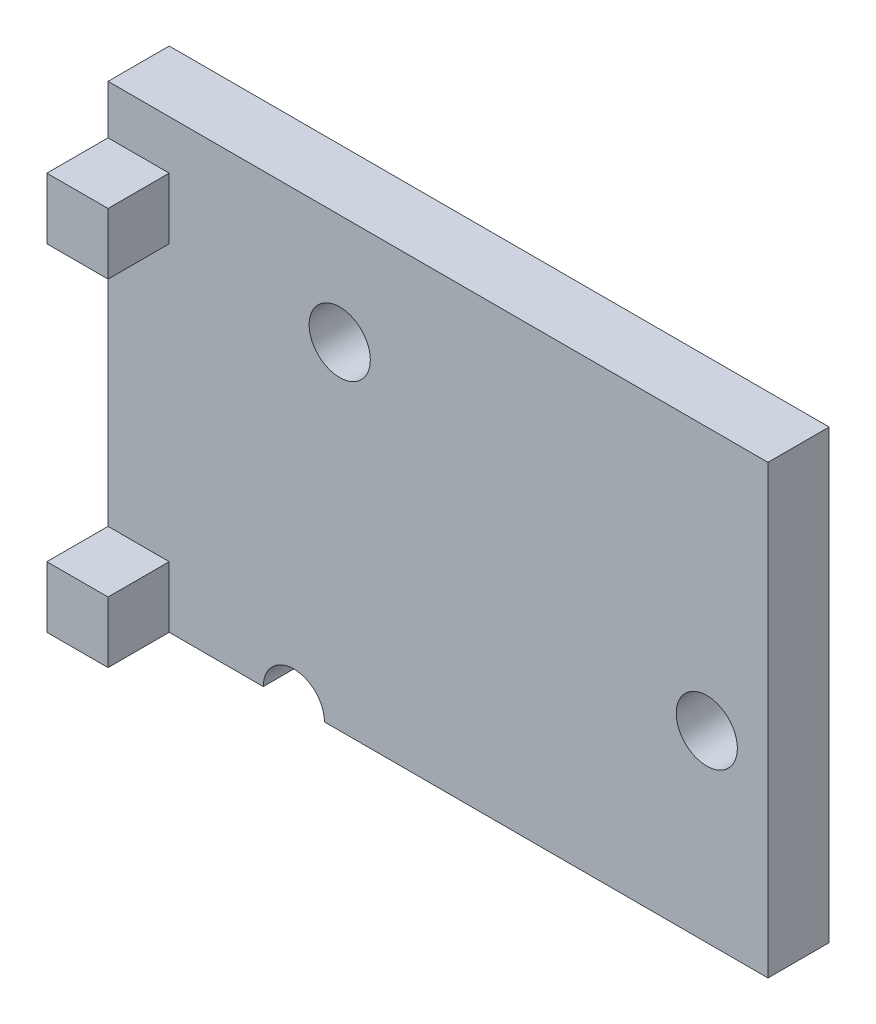
ISO-10303-21;
HEADER;
FILE_DESCRIPTION(('STEP AP214'),'2;1');
FILE_NAME('part.step','',(''),(''),'','','');
FILE_SCHEMA(('AUTOMOTIVE_DESIGN { 1 0 10303 214 1 1 1 1 }'));
ENDSEC;
DATA;
#1=APPLICATION_CONTEXT('core data for automotive mechanical design processes');
#2=APPLICATION_PROTOCOL_DEFINITION('international standard','automotive_design',2000,#1);
#3=PRODUCT_CONTEXT('',#1,'mechanical');
#4=PRODUCT('Part','Part','',(#3));
#5=PRODUCT_RELATED_PRODUCT_CATEGORY('part','',(#4));
#6=PRODUCT_DEFINITION_FORMATION('','',#4);
#7=PRODUCT_DEFINITION_CONTEXT('part definition',#1,'design');
#8=PRODUCT_DEFINITION('design','',#6,#7);
#9=PRODUCT_DEFINITION_SHAPE('','',#8);
#10=(LENGTH_UNIT() NAMED_UNIT(*) SI_UNIT(.MILLI.,.METRE.));
#11=(NAMED_UNIT(*) PLANE_ANGLE_UNIT() SI_UNIT($,.RADIAN.));
#12=(NAMED_UNIT(*) SI_UNIT($,.STERADIAN.) SOLID_ANGLE_UNIT());
#13=UNCERTAINTY_MEASURE_WITH_UNIT(LENGTH_MEASURE(1.E-05),#10,'distance_accuracy_value','');
#14=(GEOMETRIC_REPRESENTATION_CONTEXT(3) GLOBAL_UNCERTAINTY_ASSIGNED_CONTEXT((#13)) GLOBAL_UNIT_ASSIGNED_CONTEXT((#10,
#11,#12)) REPRESENTATION_CONTEXT('',''));
#15=CARTESIAN_POINT('',(0.,0.,0.));
#16=DIRECTION('',(0.,0.,1.));
#17=DIRECTION('',(1.,0.,0.));
#18=AXIS2_PLACEMENT_3D('',#15,#16,#17);
#19=CARTESIAN_POINT('',(4.5,3.25,1.));
#20=DIRECTION('',(0.,-1.,0.));
#21=DIRECTION('',(1.,0.,0.));
#22=AXIS2_PLACEMENT_3D('',#19,#20,#21);
#23=PLANE('',#22);
#24=DIRECTION('',(1.,0.,0.));
#25=VECTOR('',#24,1.);
#26=CARTESIAN_POINT('',(4.5,3.25,1.));
#27=LINE('',#26,#25);
#28=CARTESIAN_POINT('',(-6.2874,3.25,1.));
#29=VERTEX_POINT('',#28);
#30=CARTESIAN_POINT('',(-5.2874,3.25,1.));
#31=VERTEX_POINT('',#30);
#32=EDGE_CURVE('E159',#29,#31,#27,.T.);
#33=ORIENTED_EDGE('',*,*,#32,.F.);
#34=DIRECTION('',(0.,0.,-1.));
#35=VECTOR('',#34,1.);
#36=CARTESIAN_POINT('',(-6.2874,3.25,0.));
#37=LINE('',#36,#35);
#38=CARTESIAN_POINT('',(-6.2874,3.25,2.));
#39=VERTEX_POINT('',#38);
#40=EDGE_CURVE('E216',#39,#29,#37,.T.);
#41=ORIENTED_EDGE('',*,*,#40,.F.);
#42=DIRECTION('',(-1.,0.,0.));
#43=VECTOR('',#42,1.);
#44=CARTESIAN_POINT('',(-6.2874,3.25,2.));
#45=LINE('',#44,#43);
#46=CARTESIAN_POINT('',(-5.2874,3.25,2.));
#47=VERTEX_POINT('',#46);
#48=EDGE_CURVE('E196',#47,#39,#45,.T.);
#49=ORIENTED_EDGE('',*,*,#48,.F.);
#50=DIRECTION('',(0.,0.,-1.));
#51=VECTOR('',#50,1.);
#52=CARTESIAN_POINT('',(-5.2874,3.25,2.));
#53=LINE('',#52,#51);
#54=EDGE_CURVE('E199',#47,#31,#53,.T.);
#55=ORIENTED_EDGE('',*,*,#54,.T.);
#56=EDGE_LOOP('',(#33,#41,#49,#55));
#57=FACE_BOUND('',#56,.T.);
#58=ADVANCED_FACE('F33',(#57),#23,.F.);
#59=CARTESIAN_POINT('',(-3.25,-3.25,1.));
#60=DIRECTION('',(0.,0.,1.));
#61=DIRECTION('',(1.,0.,0.));
#62=AXIS2_PLACEMENT_3D('',#59,#60,#61);
#63=PLANE('',#62);
#64=CARTESIAN_POINT('',(3.5,-0.249999999999999,1.));
#65=DIRECTION('',(0.,0.,1.));
#66=DIRECTION('',(1.,0.,0.));
#67=AXIS2_PLACEMENT_3D('',#64,#65,#66);
#68=CIRCLE('',#67,0.500000000000001);
#69=CARTESIAN_POINT('',(4.,-0.249999999999999,1.));
#70=VERTEX_POINT('',#69);
#71=EDGE_CURVE('E223',#70,#70,#68,.T.);
#72=ORIENTED_EDGE('',*,*,#71,.F.);
#73=EDGE_LOOP('',(#72));
#74=FACE_BOUND('',#73,.T.);
#75=CARTESIAN_POINT('',(-2.5,2.25,1.));
#76=DIRECTION('',(0.,0.,1.));
#77=DIRECTION('',(1.,0.,0.));
#78=AXIS2_PLACEMENT_3D('',#75,#76,#77);
#79=CIRCLE('',#78,0.5);
#80=CARTESIAN_POINT('',(-2.,2.25,1.));
#81=VERTEX_POINT('',#80);
#82=EDGE_CURVE('E230',#81,#81,#79,.T.);
#83=ORIENTED_EDGE('',*,*,#82,.F.);
#84=EDGE_LOOP('',(#83));
#85=FACE_BOUND('',#84,.T.);
#86=DIRECTION('',(-1.,0.,0.));
#87=VECTOR('',#86,1.);
#88=CARTESIAN_POINT('',(-6.2874,-2.25,1.));
#89=LINE('',#88,#87);
#90=CARTESIAN_POINT('',(-5.2874,-2.25,1.));
#91=VERTEX_POINT('',#90);
#92=CARTESIAN_POINT('',(-6.2874,-2.25,1.));
#93=VERTEX_POINT('',#92);
#94=EDGE_CURVE('E172',#91,#93,#89,.T.);
#95=ORIENTED_EDGE('',*,*,#94,.F.);
#96=DIRECTION('',(0.,1.,0.));
#97=VECTOR('',#96,1.);
#98=CARTESIAN_POINT('',(-5.2874,-3.25,1.));
#99=LINE('',#98,#97);
#100=CARTESIAN_POINT('',(-5.2874,-3.25,1.));
#101=VERTEX_POINT('',#100);
#102=EDGE_CURVE('E178',#101,#91,#99,.T.);
#103=ORIENTED_EDGE('',*,*,#102,.F.);
#104=DIRECTION('',(1.,0.,0.));
#105=VECTOR('',#104,1.);
#106=CARTESIAN_POINT('',(-3.75,-3.25,1.));
#107=LINE('',#106,#105);
#108=CARTESIAN_POINT('',(-3.75,-3.25,1.));
#109=VERTEX_POINT('',#108);
#110=EDGE_CURVE('E142',#101,#109,#107,.T.);
#111=ORIENTED_EDGE('',*,*,#110,.T.);
#112=CARTESIAN_POINT('',(-3.25,-3.25,1.));
#113=DIRECTION('',(0.,0.,-1.));
#114=DIRECTION('',(1.,0.,0.));
#115=AXIS2_PLACEMENT_3D('',#112,#113,#114);
#116=CIRCLE('',#115,0.5);
#117=CARTESIAN_POINT('',(-2.75,-3.25,1.));
#118=VERTEX_POINT('',#117);
#119=EDGE_CURVE('E237',#109,#118,#116,.T.);
#120=ORIENTED_EDGE('',*,*,#119,.T.);
#121=DIRECTION('',(1.,0.,0.));
#122=VECTOR('',#121,1.);
#123=CARTESIAN_POINT('',(4.5,-3.25,1.));
#124=LINE('',#123,#122);
#125=CARTESIAN_POINT('',(4.5,-3.25,1.));
#126=VERTEX_POINT('',#125);
#127=EDGE_CURVE('E239',#118,#126,#124,.T.);
#128=ORIENTED_EDGE('',*,*,#127,.T.);
#129=DIRECTION('',(0.,1.,0.));
#130=VECTOR('',#129,1.);
#131=CARTESIAN_POINT('',(4.5,3.25,1.));
#132=LINE('',#131,#130);
#133=CARTESIAN_POINT('',(4.5,4.05,1.));
#134=VERTEX_POINT('',#133);
#135=EDGE_CURVE('E241',#126,#134,#132,.T.);
#136=ORIENTED_EDGE('',*,*,#135,.T.);
#137=DIRECTION('',(1.,0.,0.));
#138=VECTOR('',#137,1.);
#139=CARTESIAN_POINT('',(4.5,4.05,1.));
#140=LINE('',#139,#138);
#141=CARTESIAN_POINT('',(-6.2874,4.05,1.));
#142=VERTEX_POINT('',#141);
#143=EDGE_CURVE('E158',#142,#134,#140,.T.);
#144=ORIENTED_EDGE('',*,*,#143,.F.);
#145=DIRECTION('',(0.,-1.,0.));
#146=VECTOR('',#145,1.);
#147=CARTESIAN_POINT('',(-6.2874,4.05,1.));
#148=LINE('',#147,#146);
#149=EDGE_CURVE('E165',#142,#29,#148,.T.);
#150=ORIENTED_EDGE('',*,*,#149,.T.);
#151=ORIENTED_EDGE('',*,*,#32,.T.);
#152=DIRECTION('',(0.,1.,0.));
#153=VECTOR('',#152,1.);
#154=CARTESIAN_POINT('',(-5.2874,3.25,1.));
#155=LINE('',#154,#153);
#156=CARTESIAN_POINT('',(-5.2874,2.25,1.));
#157=VERTEX_POINT('',#156);
#158=EDGE_CURVE('E192',#157,#31,#155,.T.);
#159=ORIENTED_EDGE('',*,*,#158,.F.);
#160=DIRECTION('',(1.,0.,0.));
#161=VECTOR('',#160,1.);
#162=CARTESIAN_POINT('',(-6.2874,2.25,1.));
#163=LINE('',#162,#161);
#164=CARTESIAN_POINT('',(-6.2874,2.25,1.));
#165=VERTEX_POINT('',#164);
#166=EDGE_CURVE('E187',#165,#157,#163,.T.);
#167=ORIENTED_EDGE('',*,*,#166,.F.);
#168=DIRECTION('',(0.,1.,0.));
#169=VECTOR('',#168,1.);
#170=CARTESIAN_POINT('',(-6.2874,3.25,1.));
#171=LINE('',#170,#169);
#172=EDGE_CURVE('E55',#93,#165,#171,.T.);
#173=ORIENTED_EDGE('',*,*,#172,.F.);
#174=EDGE_LOOP('',(#95,#103,#111,#120,#128,#136,#144,#150,#151,#159,#167,#173));
#175=FACE_BOUND('',#174,.T.);
#176=ADVANCED_FACE('F265',(#74,#85,#175),#63,.T.);
#177=CARTESIAN_POINT('',(-3.25,-3.25,0.));
#178=DIRECTION('',(0.,0.,1.));
#179=DIRECTION('',(1.,0.,0.));
#180=AXIS2_PLACEMENT_3D('',#177,#178,#179);
#181=PLANE('',#180);
#182=CARTESIAN_POINT('',(-2.5,2.25,0.));
#183=DIRECTION('',(0.,0.,1.));
#184=DIRECTION('',(1.,0.,0.));
#185=AXIS2_PLACEMENT_3D('',#182,#183,#184);
#186=CIRCLE('',#185,0.5);
#187=CARTESIAN_POINT('',(-2.,2.25,0.));
#188=VERTEX_POINT('',#187);
#189=EDGE_CURVE('E226',#188,#188,#186,.T.);
#190=ORIENTED_EDGE('',*,*,#189,.T.);
#191=EDGE_LOOP('',(#190));
#192=FACE_BOUND('',#191,.T.);
#193=DIRECTION('',(1.,0.,0.));
#194=VECTOR('',#193,1.);
#195=CARTESIAN_POINT('',(-3.75,-3.25,0.));
#196=LINE('',#195,#194);
#197=CARTESIAN_POINT('',(-6.2874,-3.25,0.));
#198=VERTEX_POINT('',#197);
#199=CARTESIAN_POINT('',(-3.75,-3.25,0.));
#200=VERTEX_POINT('',#199);
#201=EDGE_CURVE('E233',#198,#200,#196,.T.);
#202=ORIENTED_EDGE('',*,*,#201,.F.);
#203=DIRECTION('',(0.,-1.,0.));
#204=VECTOR('',#203,1.);
#205=CARTESIAN_POINT('',(-6.2874,3.25,0.));
#206=LINE('',#205,#204);
#207=CARTESIAN_POINT('',(-6.2874,4.05,0.));
#208=VERTEX_POINT('',#207);
#209=EDGE_CURVE('E150',#208,#198,#206,.T.);
#210=ORIENTED_EDGE('',*,*,#209,.F.);
#211=DIRECTION('',(-1.,0.,0.));
#212=VECTOR('',#211,1.);
#213=CARTESIAN_POINT('',(4.5,4.05,0.));
#214=LINE('',#213,#212);
#215=CARTESIAN_POINT('',(4.5,4.05,0.));
#216=VERTEX_POINT('',#215);
#217=EDGE_CURVE('E146',#216,#208,#214,.T.);
#218=ORIENTED_EDGE('',*,*,#217,.F.);
#219=DIRECTION('',(0.,1.,0.));
#220=VECTOR('',#219,1.);
#221=CARTESIAN_POINT('',(4.5,3.25,0.));
#222=LINE('',#221,#220);
#223=CARTESIAN_POINT('',(4.5,-3.25,0.));
#224=VERTEX_POINT('',#223);
#225=EDGE_CURVE('E132',#224,#216,#222,.T.);
#226=ORIENTED_EDGE('',*,*,#225,.F.);
#227=DIRECTION('',(1.,0.,0.));
#228=VECTOR('',#227,1.);
#229=CARTESIAN_POINT('',(4.5,-3.25,0.));
#230=LINE('',#229,#228);
#231=CARTESIAN_POINT('',(-2.75,-3.25,0.));
#232=VERTEX_POINT('',#231);
#233=EDGE_CURVE('E143',#232,#224,#230,.T.);
#234=ORIENTED_EDGE('',*,*,#233,.F.);
#235=CARTESIAN_POINT('',(-3.25,-3.25,0.));
#236=DIRECTION('',(0.,0.,-1.));
#237=DIRECTION('',(1.,0.,0.));
#238=AXIS2_PLACEMENT_3D('',#235,#236,#237);
#239=CIRCLE('',#238,0.5);
#240=EDGE_CURVE('E244',#200,#232,#239,.T.);
#241=ORIENTED_EDGE('',*,*,#240,.F.);
#242=EDGE_LOOP('',(#202,#210,#218,#226,#234,#241));
#243=FACE_BOUND('',#242,.T.);
#244=CARTESIAN_POINT('',(3.5,-0.249999999999999,0.));
#245=DIRECTION('',(0.,0.,1.));
#246=DIRECTION('',(1.,0.,0.));
#247=AXIS2_PLACEMENT_3D('',#244,#245,#246);
#248=CIRCLE('',#247,0.500000000000001);
#249=CARTESIAN_POINT('',(4.,-0.249999999999999,0.));
#250=VERTEX_POINT('',#249);
#251=EDGE_CURVE('E227',#250,#250,#248,.T.);
#252=ORIENTED_EDGE('',*,*,#251,.T.);
#253=EDGE_LOOP('',(#252));
#254=FACE_BOUND('',#253,.T.);
#255=ADVANCED_FACE('F147',(#192,#243,#254),#181,.F.);
#256=CARTESIAN_POINT('',(-3.75,-3.25,1.));
#257=DIRECTION('',(0.,1.,0.));
#258=DIRECTION('',(0.,0.,1.));
#259=AXIS2_PLACEMENT_3D('',#256,#257,#258);
#260=PLANE('',#259);
#261=ORIENTED_EDGE('',*,*,#201,.T.);
#262=DIRECTION('',(0.,0.,-1.));
#263=VECTOR('',#262,1.);
#264=CARTESIAN_POINT('',(-3.75,-3.25,1.));
#265=LINE('',#264,#263);
#266=EDGE_CURVE('E11',#109,#200,#265,.T.);
#267=ORIENTED_EDGE('',*,*,#266,.F.);
#268=ORIENTED_EDGE('',*,*,#110,.F.);
#269=DIRECTION('',(0.,0.,-1.));
#270=VECTOR('',#269,1.);
#271=CARTESIAN_POINT('',(-5.2874,-3.25,2.));
#272=LINE('',#271,#270);
#273=CARTESIAN_POINT('',(-5.2874,-3.25,2.));
#274=VERTEX_POINT('',#273);
#275=EDGE_CURVE('E185',#274,#101,#272,.T.);
#276=ORIENTED_EDGE('',*,*,#275,.F.);
#277=DIRECTION('',(1.,0.,0.));
#278=VECTOR('',#277,1.);
#279=CARTESIAN_POINT('',(-6.2874,-3.25,2.));
#280=LINE('',#279,#278);
#281=CARTESIAN_POINT('',(-6.2874,-3.25,2.));
#282=VERTEX_POINT('',#281);
#283=EDGE_CURVE('E171',#282,#274,#280,.T.);
#284=ORIENTED_EDGE('',*,*,#283,.F.);
#285=DIRECTION('',(0.,0.,1.));
#286=VECTOR('',#285,1.);
#287=CARTESIAN_POINT('',(-6.2874,-3.25,0.));
#288=LINE('',#287,#286);
#289=EDGE_CURVE('E217',#198,#282,#288,.T.);
#290=ORIENTED_EDGE('',*,*,#289,.F.);
#291=EDGE_LOOP('',(#261,#267,#268,#276,#284,#290));
#292=FACE_BOUND('',#291,.T.);
#293=ADVANCED_FACE('F35',(#292),#260,.F.);
#294=CARTESIAN_POINT('',(-3.25,-3.25,1.));
#295=DIRECTION('',(0.,0.,-1.));
#296=DIRECTION('',(-1.,0.,0.));
#297=AXIS2_PLACEMENT_3D('',#294,#295,#296);
#298=CYLINDRICAL_SURFACE('',#297,0.5);
#299=ORIENTED_EDGE('',*,*,#240,.T.);
#300=DIRECTION('',(0.,0.,-1.));
#301=VECTOR('',#300,1.);
#302=CARTESIAN_POINT('',(-2.75,-3.25,1.));
#303=LINE('',#302,#301);
#304=EDGE_CURVE('E42',#118,#232,#303,.T.);
#305=ORIENTED_EDGE('',*,*,#304,.F.);
#306=ORIENTED_EDGE('',*,*,#119,.F.);
#307=ORIENTED_EDGE('',*,*,#266,.T.);
#308=EDGE_LOOP('',(#299,#305,#306,#307));
#309=FACE_BOUND('',#308,.T.);
#310=ADVANCED_FACE('F303',(#309),#298,.F.);
#311=CARTESIAN_POINT('',(4.5,-3.25,1.));
#312=DIRECTION('',(0.,1.,0.));
#313=DIRECTION('',(-1.,0.,0.));
#314=AXIS2_PLACEMENT_3D('',#311,#312,#313);
#315=PLANE('',#314);
#316=ORIENTED_EDGE('',*,*,#233,.T.);
#317=DIRECTION('',(0.,0.,-1.));
#318=VECTOR('',#317,1.);
#319=CARTESIAN_POINT('',(4.5,-3.25,1.));
#320=LINE('',#319,#318);
#321=EDGE_CURVE('E139',#126,#224,#320,.T.);
#322=ORIENTED_EDGE('',*,*,#321,.F.);
#323=ORIENTED_EDGE('',*,*,#127,.F.);
#324=ORIENTED_EDGE('',*,*,#304,.T.);
#325=EDGE_LOOP('',(#316,#322,#323,#324));
#326=FACE_BOUND('',#325,.T.);
#327=ADVANCED_FACE('F301',(#326),#315,.F.);
#328=CARTESIAN_POINT('',(4.5,3.25,1.));
#329=DIRECTION('',(-1.,0.,0.));
#330=DIRECTION('',(0.,-1.,0.));
#331=AXIS2_PLACEMENT_3D('',#328,#329,#330);
#332=PLANE('',#331);
#333=ORIENTED_EDGE('',*,*,#225,.T.);
#334=DIRECTION('',(0.,0.,-1.));
#335=VECTOR('',#334,1.);
#336=CARTESIAN_POINT('',(4.5,4.05,1.));
#337=LINE('',#336,#335);
#338=EDGE_CURVE('E137',#134,#216,#337,.T.);
#339=ORIENTED_EDGE('',*,*,#338,.F.);
#340=ORIENTED_EDGE('',*,*,#135,.F.);
#341=ORIENTED_EDGE('',*,*,#321,.T.);
#342=EDGE_LOOP('',(#333,#339,#340,#341));
#343=FACE_BOUND('',#342,.T.);
#344=ADVANCED_FACE('F134',(#343),#332,.F.);
#345=CARTESIAN_POINT('',(-2.5,2.25,1.));
#346=DIRECTION('',(0.,0.,-1.));
#347=DIRECTION('',(-1.,0.,0.));
#348=AXIS2_PLACEMENT_3D('',#345,#346,#347);
#349=CYLINDRICAL_SURFACE('',#348,0.5);
#350=ORIENTED_EDGE('',*,*,#82,.T.);
#351=EDGE_LOOP('',(#350));
#352=FACE_BOUND('',#351,.T.);
#353=ORIENTED_EDGE('',*,*,#189,.F.);
#354=EDGE_LOOP('',(#353));
#355=FACE_BOUND('',#354,.T.);
#356=ADVANCED_FACE('F300',(#352,#355),#349,.F.);
#357=CARTESIAN_POINT('',(3.5,-0.249999999999999,1.));
#358=DIRECTION('',(0.,0.,-1.));
#359=DIRECTION('',(-1.,0.,0.));
#360=AXIS2_PLACEMENT_3D('',#357,#358,#359);
#361=CYLINDRICAL_SURFACE('',#360,0.500000000000001);
#362=ORIENTED_EDGE('',*,*,#71,.T.);
#363=EDGE_LOOP('',(#362));
#364=FACE_BOUND('',#363,.T.);
#365=ORIENTED_EDGE('',*,*,#251,.F.);
#366=EDGE_LOOP('',(#365));
#367=FACE_BOUND('',#366,.T.);
#368=ADVANCED_FACE('F342',(#364,#367),#361,.F.);
#369=CARTESIAN_POINT('',(-6.2874,0.,0.));
#370=DIRECTION('',(-1.,0.,0.));
#371=DIRECTION('',(0.,0.,1.));
#372=AXIS2_PLACEMENT_3D('',#369,#370,#371);
#373=PLANE('',#372);
#374=ORIENTED_EDGE('',*,*,#209,.T.);
#375=ORIENTED_EDGE('',*,*,#289,.T.);
#376=DIRECTION('',(0.,-1.,0.));
#377=VECTOR('',#376,1.);
#378=CARTESIAN_POINT('',(-6.2874,-3.25,2.));
#379=LINE('',#378,#377);
#380=CARTESIAN_POINT('',(-6.2874,-2.25,2.));
#381=VERTEX_POINT('',#380);
#382=EDGE_CURVE('E168',#381,#282,#379,.T.);
#383=ORIENTED_EDGE('',*,*,#382,.F.);
#384=DIRECTION('',(0.,0.,-1.));
#385=VECTOR('',#384,1.);
#386=CARTESIAN_POINT('',(-6.2874,-2.25,2.));
#387=LINE('',#386,#385);
#388=EDGE_CURVE('E50',#381,#93,#387,.T.);
#389=ORIENTED_EDGE('',*,*,#388,.T.);
#390=ORIENTED_EDGE('',*,*,#172,.T.);
#391=DIRECTION('',(0.,0.,-1.));
#392=VECTOR('',#391,1.);
#393=CARTESIAN_POINT('',(-6.2874,2.25,2.));
#394=LINE('',#393,#392);
#395=CARTESIAN_POINT('',(-6.2874,2.25,2.));
#396=VERTEX_POINT('',#395);
#397=EDGE_CURVE('E253',#396,#165,#394,.T.);
#398=ORIENTED_EDGE('',*,*,#397,.F.);
#399=DIRECTION('',(0.,-1.,0.));
#400=VECTOR('',#399,1.);
#401=CARTESIAN_POINT('',(-6.2874,3.25,2.));
#402=LINE('',#401,#400);
#403=EDGE_CURVE('E188',#39,#396,#402,.T.);
#404=ORIENTED_EDGE('',*,*,#403,.F.);
#405=ORIENTED_EDGE('',*,*,#40,.T.);
#406=ORIENTED_EDGE('',*,*,#149,.F.);
#407=DIRECTION('',(0.,0.,1.));
#408=VECTOR('',#407,1.);
#409=CARTESIAN_POINT('',(-6.2874,4.05,1.));
#410=LINE('',#409,#408);
#411=EDGE_CURVE('E153',#208,#142,#410,.T.);
#412=ORIENTED_EDGE('',*,*,#411,.F.);
#413=EDGE_LOOP('',(#374,#375,#383,#389,#390,#398,#404,#405,#406,#412));
#414=FACE_BOUND('',#413,.T.);
#415=ADVANCED_FACE('F272',(#414),#373,.T.);
#416=CARTESIAN_POINT('',(-6.2874,2.25,2.));
#417=DIRECTION('',(0.,1.,0.));
#418=DIRECTION('',(0.,0.,1.));
#419=AXIS2_PLACEMENT_3D('',#416,#417,#418);
#420=PLANE('',#419);
#421=ORIENTED_EDGE('',*,*,#166,.T.);
#422=DIRECTION('',(0.,0.,-1.));
#423=VECTOR('',#422,1.);
#424=CARTESIAN_POINT('',(-5.2874,2.25,2.));
#425=LINE('',#424,#423);
#426=CARTESIAN_POINT('',(-5.2874,2.25,2.));
#427=VERTEX_POINT('',#426);
#428=EDGE_CURVE('E202',#427,#157,#425,.T.);
#429=ORIENTED_EDGE('',*,*,#428,.F.);
#430=DIRECTION('',(1.,0.,0.));
#431=VECTOR('',#430,1.);
#432=CARTESIAN_POINT('',(-6.2874,2.25,2.));
#433=LINE('',#432,#431);
#434=EDGE_CURVE('E191',#396,#427,#433,.T.);
#435=ORIENTED_EDGE('',*,*,#434,.F.);
#436=ORIENTED_EDGE('',*,*,#397,.T.);
#437=EDGE_LOOP('',(#421,#429,#435,#436));
#438=FACE_BOUND('',#437,.T.);
#439=ADVANCED_FACE('F262',(#438),#420,.F.);
#440=CARTESIAN_POINT('',(-5.2874,3.25,2.));
#441=DIRECTION('',(-1.,0.,0.));
#442=DIRECTION('',(0.,0.,1.));
#443=AXIS2_PLACEMENT_3D('',#440,#441,#442);
#444=PLANE('',#443);
#445=ORIENTED_EDGE('',*,*,#158,.T.);
#446=ORIENTED_EDGE('',*,*,#54,.F.);
#447=DIRECTION('',(0.,1.,0.));
#448=VECTOR('',#447,1.);
#449=CARTESIAN_POINT('',(-5.2874,3.25,2.));
#450=LINE('',#449,#448);
#451=EDGE_CURVE('E194',#427,#47,#450,.T.);
#452=ORIENTED_EDGE('',*,*,#451,.F.);
#453=ORIENTED_EDGE('',*,*,#428,.T.);
#454=EDGE_LOOP('',(#445,#446,#452,#453));
#455=FACE_BOUND('',#454,.T.);
#456=ADVANCED_FACE('F260',(#455),#444,.F.);
#457=CARTESIAN_POINT('',(0.,0.,2.));
#458=DIRECTION('',(0.,0.,1.));
#459=DIRECTION('',(1.,0.,0.));
#460=AXIS2_PLACEMENT_3D('',#457,#458,#459);
#461=PLANE('',#460);
#462=ORIENTED_EDGE('',*,*,#403,.T.);
#463=ORIENTED_EDGE('',*,*,#434,.T.);
#464=ORIENTED_EDGE('',*,*,#451,.T.);
#465=ORIENTED_EDGE('',*,*,#48,.T.);
#466=EDGE_LOOP('',(#462,#463,#464,#465));
#467=FACE_BOUND('',#466,.T.);
#468=ADVANCED_FACE('F274',(#467),#461,.T.);
#469=CARTESIAN_POINT('',(-5.2874,-3.25,2.));
#470=DIRECTION('',(-1.,0.,0.));
#471=DIRECTION('',(0.,0.,1.));
#472=AXIS2_PLACEMENT_3D('',#469,#470,#471);
#473=PLANE('',#472);
#474=ORIENTED_EDGE('',*,*,#102,.T.);
#475=DIRECTION('',(0.,0.,-1.));
#476=VECTOR('',#475,1.);
#477=CARTESIAN_POINT('',(-5.2874,-2.25,2.));
#478=LINE('',#477,#476);
#479=CARTESIAN_POINT('',(-5.2874,-2.25,2.));
#480=VERTEX_POINT('',#479);
#481=EDGE_CURVE('E182',#480,#91,#478,.T.);
#482=ORIENTED_EDGE('',*,*,#481,.F.);
#483=DIRECTION('',(0.,1.,0.));
#484=VECTOR('',#483,1.);
#485=CARTESIAN_POINT('',(-5.2874,-3.25,2.));
#486=LINE('',#485,#484);
#487=EDGE_CURVE('E174',#274,#480,#486,.T.);
#488=ORIENTED_EDGE('',*,*,#487,.F.);
#489=ORIENTED_EDGE('',*,*,#275,.T.);
#490=EDGE_LOOP('',(#474,#482,#488,#489));
#491=FACE_BOUND('',#490,.T.);
#492=ADVANCED_FACE('F276',(#491),#473,.F.);
#493=CARTESIAN_POINT('',(-6.2874,-2.25,2.));
#494=DIRECTION('',(0.,-1.,0.));
#495=DIRECTION('',(0.,0.,-1.));
#496=AXIS2_PLACEMENT_3D('',#493,#494,#495);
#497=PLANE('',#496);
#498=ORIENTED_EDGE('',*,*,#94,.T.);
#499=ORIENTED_EDGE('',*,*,#388,.F.);
#500=DIRECTION('',(-1.,0.,0.));
#501=VECTOR('',#500,1.);
#502=CARTESIAN_POINT('',(-6.2874,-2.25,2.));
#503=LINE('',#502,#501);
#504=EDGE_CURVE('E176',#480,#381,#503,.T.);
#505=ORIENTED_EDGE('',*,*,#504,.F.);
#506=ORIENTED_EDGE('',*,*,#481,.T.);
#507=EDGE_LOOP('',(#498,#499,#505,#506));
#508=FACE_BOUND('',#507,.T.);
#509=ADVANCED_FACE('F282',(#508),#497,.F.);
#510=CARTESIAN_POINT('',(0.,0.,2.));
#511=DIRECTION('',(0.,0.,-1.));
#512=DIRECTION('',(-1.,0.,0.));
#513=AXIS2_PLACEMENT_3D('',#510,#511,#512);
#514=PLANE('',#513);
#515=ORIENTED_EDGE('',*,*,#382,.T.);
#516=ORIENTED_EDGE('',*,*,#283,.T.);
#517=ORIENTED_EDGE('',*,*,#487,.T.);
#518=ORIENTED_EDGE('',*,*,#504,.T.);
#519=EDGE_LOOP('',(#515,#516,#517,#518));
#520=FACE_BOUND('',#519,.T.);
#521=ADVANCED_FACE('F322',(#520),#514,.F.);
#522=CARTESIAN_POINT('',(0.,4.05,0.));
#523=DIRECTION('',(0.,1.,0.));
#524=DIRECTION('',(-1.,0.,0.));
#525=AXIS2_PLACEMENT_3D('',#522,#523,#524);
#526=PLANE('',#525);
#527=ORIENTED_EDGE('',*,*,#338,.T.);
#528=ORIENTED_EDGE('',*,*,#217,.T.);
#529=ORIENTED_EDGE('',*,*,#411,.T.);
#530=ORIENTED_EDGE('',*,*,#143,.T.);
#531=EDGE_LOOP('',(#527,#528,#529,#530));
#532=FACE_BOUND('',#531,.T.);
#533=ADVANCED_FACE('F156',(#532),#526,.T.);
#534=CLOSED_SHELL('',(#58,#176,#255,#293,#310,#327,#344,#356,#368,#415,#439,#456,#468,#492,#509,
#521,#533));
#535=MANIFOLD_SOLID_BREP('B2',#534);
#536=ADVANCED_BREP_SHAPE_REPRESENTATION('',(#18,#535),#14);
#537=SHAPE_DEFINITION_REPRESENTATION(#9,#536);
ENDSEC;
END-ISO-10303-21;
